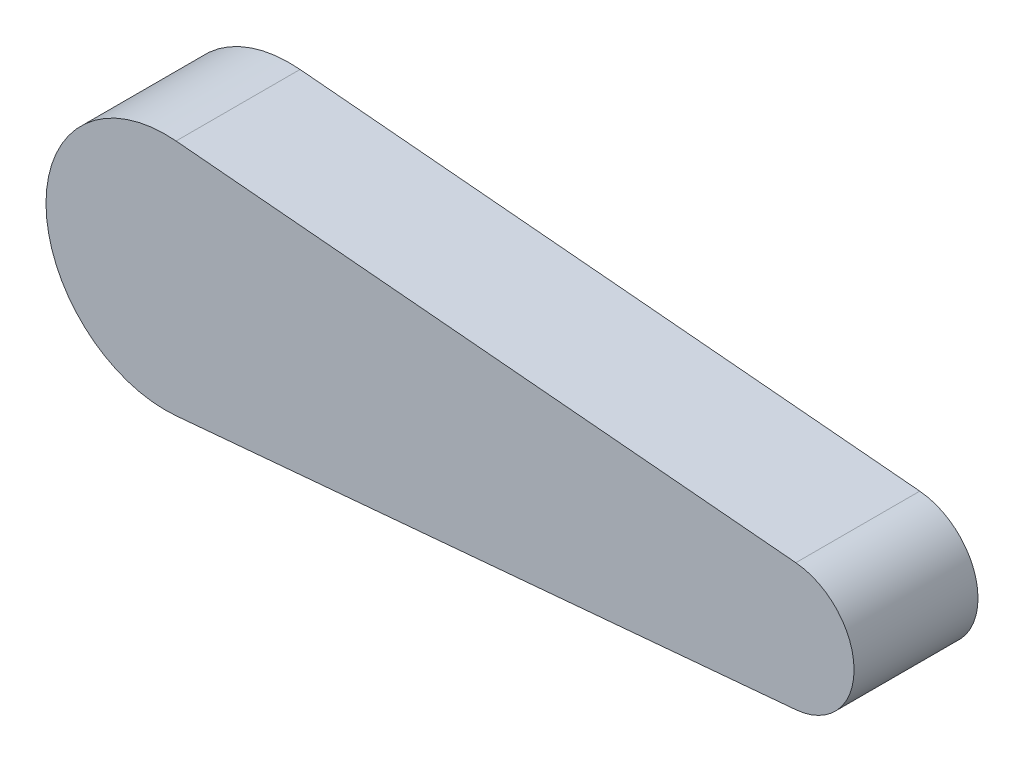
ISO-10303-21;
HEADER;
FILE_DESCRIPTION(('STEP AP214'),'2;1');
FILE_NAME('part.step','',(''),(''),'','','');
FILE_SCHEMA(('AUTOMOTIVE_DESIGN { 1 0 10303 214 1 1 1 1 }'));
ENDSEC;
DATA;
#1=APPLICATION_CONTEXT('core data for automotive mechanical design processes');
#2=APPLICATION_PROTOCOL_DEFINITION('international standard','automotive_design',2000,#1);
#3=PRODUCT_CONTEXT('',#1,'mechanical');
#4=PRODUCT('Part','Part','',(#3));
#5=PRODUCT_RELATED_PRODUCT_CATEGORY('part','',(#4));
#6=PRODUCT_DEFINITION_FORMATION('','',#4);
#7=PRODUCT_DEFINITION_CONTEXT('part definition',#1,'design');
#8=PRODUCT_DEFINITION('design','',#6,#7);
#9=PRODUCT_DEFINITION_SHAPE('','',#8);
#10=(LENGTH_UNIT() NAMED_UNIT(*) SI_UNIT(.MILLI.,.METRE.));
#11=(NAMED_UNIT(*) PLANE_ANGLE_UNIT() SI_UNIT($,.RADIAN.));
#12=(NAMED_UNIT(*) SI_UNIT($,.STERADIAN.) SOLID_ANGLE_UNIT());
#13=UNCERTAINTY_MEASURE_WITH_UNIT(LENGTH_MEASURE(1.E-05),#10,'distance_accuracy_value','');
#14=(GEOMETRIC_REPRESENTATION_CONTEXT(3) GLOBAL_UNCERTAINTY_ASSIGNED_CONTEXT((#13)) GLOBAL_UNIT_ASSIGNED_CONTEXT((#10,
#11,#12)) REPRESENTATION_CONTEXT('',''));
#15=CARTESIAN_POINT('',(0.,0.,0.));
#16=DIRECTION('',(0.,0.,1.));
#17=DIRECTION('',(1.,0.,0.));
#18=AXIS2_PLACEMENT_3D('',#15,#16,#17);
#19=CARTESIAN_POINT('',(9.63818954923064,0.,10.));
#20=DIRECTION('',(0.,0.,-1.));
#21=DIRECTION('',(-1.,0.,0.));
#22=AXIS2_PLACEMENT_3D('',#19,#20,#21);
#23=CYLINDRICAL_SURFACE('',#22,9.63818954923064);
#24=CARTESIAN_POINT('',(9.63818954923064,0.,0.));
#25=DIRECTION('',(0.,0.,1.));
#26=DIRECTION('',(1.,0.,0.));
#27=AXIS2_PLACEMENT_3D('',#24,#25,#26);
#28=CIRCLE('',#27,9.63818954923064);
#29=CARTESIAN_POINT('',(10.4953346868233,9.6,0.));
#30=VERTEX_POINT('',#29);
#31=CARTESIAN_POINT('',(10.4953346868233,-9.6,0.));
#32=VERTEX_POINT('',#31);
#33=EDGE_CURVE('E107',#30,#32,#28,.T.);
#34=ORIENTED_EDGE('',*,*,#33,.T.);
#35=DIRECTION('',(0.,0.,-1.));
#36=VECTOR('',#35,1.);
#37=CARTESIAN_POINT('',(10.4953346868233,-9.6,10.));
#38=LINE('',#37,#36);
#39=CARTESIAN_POINT('',(10.4953346868233,-9.6,10.));
#40=VERTEX_POINT('',#39);
#41=EDGE_CURVE('E11',#40,#32,#38,.T.);
#42=ORIENTED_EDGE('',*,*,#41,.F.);
#43=CARTESIAN_POINT('',(9.63818954923064,0.,10.));
#44=DIRECTION('',(0.,0.,1.));
#45=DIRECTION('',(1.,0.,0.));
#46=AXIS2_PLACEMENT_3D('',#43,#44,#45);
#47=CIRCLE('',#46,9.63818954923064);
#48=CARTESIAN_POINT('',(10.4953346868233,9.6,10.));
#49=VERTEX_POINT('',#48);
#50=EDGE_CURVE('E91',#49,#40,#47,.T.);
#51=ORIENTED_EDGE('',*,*,#50,.F.);
#52=DIRECTION('',(0.,0.,-1.));
#53=VECTOR('',#52,1.);
#54=CARTESIAN_POINT('',(10.4953346868233,9.6,10.));
#55=LINE('',#54,#53);
#56=EDGE_CURVE('E103',#49,#30,#55,.T.);
#57=ORIENTED_EDGE('',*,*,#56,.T.);
#58=EDGE_LOOP('',(#34,#42,#51,#57));
#59=FACE_BOUND('',#58,.T.);
#60=ADVANCED_FACE('F39',(#59),#23,.T.);
#61=CARTESIAN_POINT('',(10.4953346868233,-9.6,10.));
#62=DIRECTION('',(-0.0889321727088389,0.996037684356011,0.));
#63=DIRECTION('',(-0.996037684356011,-0.0889321727088389,0.));
#64=AXIS2_PLACEMENT_3D('',#61,#62,#63);
#65=PLANE('',#64);
#66=DIRECTION('',(0.996037684356011,0.0889321727088389,0.));
#67=VECTOR('',#66,1.);
#68=CARTESIAN_POINT('',(10.4953346868233,-9.6,0.));
#69=LINE('',#68,#67);
#70=CARTESIAN_POINT('',(60.4953346868233,-5.13570240837132,0.));
#71=VERTEX_POINT('',#70);
#72=EDGE_CURVE('E96',#32,#71,#69,.T.);
#73=ORIENTED_EDGE('',*,*,#72,.T.);
#74=DIRECTION('',(0.,0.,-1.));
#75=VECTOR('',#74,1.);
#76=CARTESIAN_POINT('',(60.4953346868233,-5.13570240837132,10.));
#77=LINE('',#76,#75);
#78=CARTESIAN_POINT('',(60.4953346868233,-5.13570240837132,10.));
#79=VERTEX_POINT('',#78);
#80=EDGE_CURVE('E48',#79,#71,#77,.T.);
#81=ORIENTED_EDGE('',*,*,#80,.F.);
#82=DIRECTION('',(0.996037684356011,0.0889321727088389,0.));
#83=VECTOR('',#82,1.);
#84=CARTESIAN_POINT('',(10.4953346868233,-9.6,10.));
#85=LINE('',#84,#83);
#86=EDGE_CURVE('E86',#40,#79,#85,.T.);
#87=ORIENTED_EDGE('',*,*,#86,.F.);
#88=ORIENTED_EDGE('',*,*,#41,.T.);
#89=EDGE_LOOP('',(#73,#81,#87,#88));
#90=FACE_BOUND('',#89,.T.);
#91=ADVANCED_FACE('F95',(#90),#65,.F.);
#92=CARTESIAN_POINT('',(60.0367886089631,0.,10.));
#93=DIRECTION('',(0.,0.,-1.));
#94=DIRECTION('',(-1.,0.,0.));
#95=AXIS2_PLACEMENT_3D('',#92,#93,#94);
#96=CYLINDRICAL_SURFACE('',#95,5.15613263336699);
#97=CARTESIAN_POINT('',(60.0367886089631,0.,0.));
#98=DIRECTION('',(0.,0.,1.));
#99=DIRECTION('',(-1.,0.,0.));
#100=AXIS2_PLACEMENT_3D('',#97,#98,#99);
#101=CIRCLE('',#100,5.15613263336699);
#102=CARTESIAN_POINT('',(60.4953346868233,5.13570240837132,0.));
#103=VERTEX_POINT('',#102);
#104=EDGE_CURVE('E73',#71,#103,#101,.T.);
#105=ORIENTED_EDGE('',*,*,#104,.T.);
#106=DIRECTION('',(0.,0.,-1.));
#107=VECTOR('',#106,1.);
#108=CARTESIAN_POINT('',(60.4953346868233,5.13570240837132,10.));
#109=LINE('',#108,#107);
#110=CARTESIAN_POINT('',(60.4953346868233,5.13570240837132,10.));
#111=VERTEX_POINT('',#110);
#112=EDGE_CURVE('E98',#111,#103,#109,.T.);
#113=ORIENTED_EDGE('',*,*,#112,.F.);
#114=CARTESIAN_POINT('',(60.0367886089631,0.,10.));
#115=DIRECTION('',(0.,0.,1.));
#116=DIRECTION('',(-1.,0.,0.));
#117=AXIS2_PLACEMENT_3D('',#114,#115,#116);
#118=CIRCLE('',#117,5.15613263336699);
#119=EDGE_CURVE('E89',#79,#111,#118,.T.);
#120=ORIENTED_EDGE('',*,*,#119,.F.);
#121=ORIENTED_EDGE('',*,*,#80,.T.);
#122=EDGE_LOOP('',(#105,#113,#120,#121));
#123=FACE_BOUND('',#122,.T.);
#124=ADVANCED_FACE('F99',(#123),#96,.T.);
#125=CARTESIAN_POINT('',(10.4953346868233,9.6,10.));
#126=DIRECTION('',(-0.0889321727088389,-0.996037684356011,0.));
#127=DIRECTION('',(0.996037684356011,-0.0889321727088389,0.));
#128=AXIS2_PLACEMENT_3D('',#125,#126,#127);
#129=PLANE('',#128);
#130=DIRECTION('',(-0.996037684356011,0.0889321727088389,0.));
#131=VECTOR('',#130,1.);
#132=CARTESIAN_POINT('',(10.4953346868233,9.6,0.));
#133=LINE('',#132,#131);
#134=EDGE_CURVE('E79',#103,#30,#133,.T.);
#135=ORIENTED_EDGE('',*,*,#134,.T.);
#136=ORIENTED_EDGE('',*,*,#56,.F.);
#137=DIRECTION('',(-0.996037684356011,0.0889321727088389,0.));
#138=VECTOR('',#137,1.);
#139=CARTESIAN_POINT('',(10.4953346868233,9.6,10.));
#140=LINE('',#139,#138);
#141=EDGE_CURVE('E56',#111,#49,#140,.T.);
#142=ORIENTED_EDGE('',*,*,#141,.F.);
#143=ORIENTED_EDGE('',*,*,#112,.T.);
#144=EDGE_LOOP('',(#135,#136,#142,#143));
#145=FACE_BOUND('',#144,.T.);
#146=ADVANCED_FACE('F121',(#145),#129,.F.);
#147=CARTESIAN_POINT('',(9.63818954923064,0.,10.));
#148=DIRECTION('',(0.,0.,1.));
#149=DIRECTION('',(1.,0.,0.));
#150=AXIS2_PLACEMENT_3D('',#147,#148,#149);
#151=PLANE('',#150);
#152=ORIENTED_EDGE('',*,*,#50,.T.);
#153=ORIENTED_EDGE('',*,*,#86,.T.);
#154=ORIENTED_EDGE('',*,*,#119,.T.);
#155=ORIENTED_EDGE('',*,*,#141,.T.);
#156=EDGE_LOOP('',(#152,#153,#154,#155));
#157=FACE_BOUND('',#156,.T.);
#158=ADVANCED_FACE('F87',(#157),#151,.T.);
#159=CARTESIAN_POINT('',(9.63818954923064,0.,0.));
#160=DIRECTION('',(0.,0.,1.));
#161=DIRECTION('',(1.,0.,0.));
#162=AXIS2_PLACEMENT_3D('',#159,#160,#161);
#163=PLANE('',#162);
#164=CARTESIAN_POINT('',(10.4953346868233,0.,0.));
#165=DIRECTION('',(0.,0.,-1.));
#166=DIRECTION('',(-1.,0.,0.));
#167=AXIS2_PLACEMENT_3D('',#164,#165,#166);
#168=CIRCLE('',#167,3.95);
#169=CARTESIAN_POINT('',(6.54533468682333,0.,0.));
#170=VERTEX_POINT('',#169);
#171=EDGE_CURVE('E128',#170,#170,#168,.T.);
#172=ORIENTED_EDGE('',*,*,#171,.F.);
#173=EDGE_LOOP('',(#172));
#174=FACE_BOUND('',#173,.T.);
#175=ORIENTED_EDGE('',*,*,#33,.F.);
#176=ORIENTED_EDGE('',*,*,#134,.F.);
#177=ORIENTED_EDGE('',*,*,#104,.F.);
#178=ORIENTED_EDGE('',*,*,#72,.F.);
#179=EDGE_LOOP('',(#175,#176,#177,#178));
#180=FACE_BOUND('',#179,.T.);
#181=ADVANCED_FACE('F124',(#174,#180),#163,.F.);
#182=CARTESIAN_POINT('',(10.4953346868233,0.,8.));
#183=DIRECTION('',(0.,0.,-1.));
#184=DIRECTION('',(-1.,0.,0.));
#185=AXIS2_PLACEMENT_3D('',#182,#183,#184);
#186=CYLINDRICAL_SURFACE('',#185,3.95);
#187=CARTESIAN_POINT('',(10.4953346868233,0.,8.));
#188=DIRECTION('',(0.,0.,-1.));
#189=DIRECTION('',(-1.,0.,0.));
#190=AXIS2_PLACEMENT_3D('',#187,#188,#189);
#191=CIRCLE('',#190,3.95);
#192=CARTESIAN_POINT('',(6.54533468682333,0.,8.));
#193=VERTEX_POINT('',#192);
#194=EDGE_CURVE('E111',#193,#193,#191,.T.);
#195=ORIENTED_EDGE('',*,*,#194,.F.);
#196=EDGE_LOOP('',(#195));
#197=FACE_BOUND('',#196,.T.);
#198=ORIENTED_EDGE('',*,*,#171,.T.);
#199=EDGE_LOOP('',(#198));
#200=FACE_BOUND('',#199,.T.);
#201=ADVANCED_FACE('F138',(#197,#200),#186,.F.);
#202=CARTESIAN_POINT('',(10.4953346868233,0.,8.));
#203=DIRECTION('',(0.,0.,-1.));
#204=DIRECTION('',(-1.,0.,0.));
#205=AXIS2_PLACEMENT_3D('',#202,#203,#204);
#206=PLANE('',#205);
#207=ORIENTED_EDGE('',*,*,#194,.T.);
#208=EDGE_LOOP('',(#207));
#209=FACE_BOUND('',#208,.T.);
#210=ADVANCED_FACE('F136',(#209),#206,.T.);
#211=CLOSED_SHELL('',(#60,#91,#124,#146,#158,#181,#201,#210));
#212=MANIFOLD_SOLID_BREP('B2',#211);
#213=ADVANCED_BREP_SHAPE_REPRESENTATION('',(#18,#212),#14);
#214=SHAPE_DEFINITION_REPRESENTATION(#9,#213);
ENDSEC;
END-ISO-10303-21;
